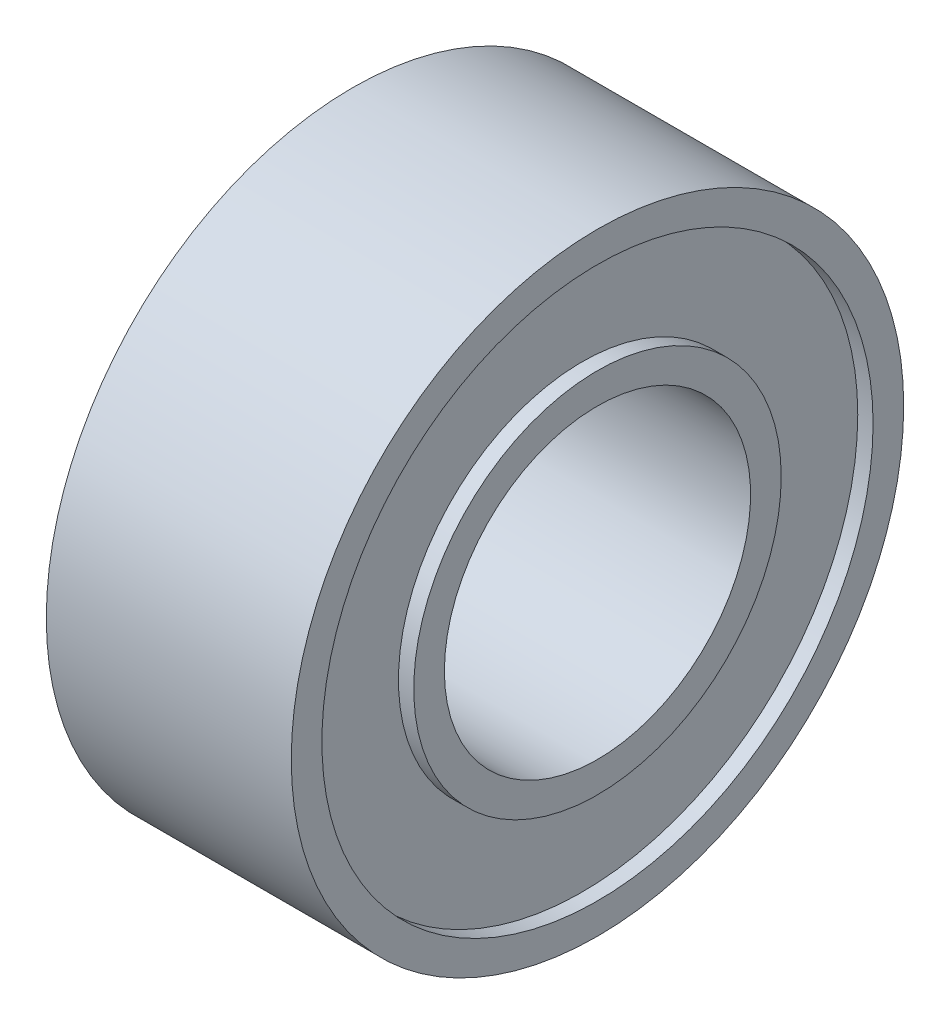
ISO-10303-21;
HEADER;
FILE_DESCRIPTION(('STEP AP214'),'2;1');
FILE_NAME('part.step','',(''),(''),'','','');
FILE_SCHEMA(('AUTOMOTIVE_DESIGN { 1 0 10303 214 1 1 1 1 }'));
ENDSEC;
DATA;
#1=APPLICATION_CONTEXT('core data for automotive mechanical design processes');
#2=APPLICATION_PROTOCOL_DEFINITION('international standard','automotive_design',2000,#1);
#3=PRODUCT_CONTEXT('',#1,'mechanical');
#4=PRODUCT('Part','Part','',(#3));
#5=PRODUCT_RELATED_PRODUCT_CATEGORY('part','',(#4));
#6=PRODUCT_DEFINITION_FORMATION('','',#4);
#7=PRODUCT_DEFINITION_CONTEXT('part definition',#1,'design');
#8=PRODUCT_DEFINITION('design','',#6,#7);
#9=PRODUCT_DEFINITION_SHAPE('','',#8);
#10=(LENGTH_UNIT() NAMED_UNIT(*) SI_UNIT(.MILLI.,.METRE.));
#11=(NAMED_UNIT(*) PLANE_ANGLE_UNIT() SI_UNIT($,.RADIAN.));
#12=(NAMED_UNIT(*) SI_UNIT($,.STERADIAN.) SOLID_ANGLE_UNIT());
#13=UNCERTAINTY_MEASURE_WITH_UNIT(LENGTH_MEASURE(1.E-05),#10,'distance_accuracy_value','');
#14=(GEOMETRIC_REPRESENTATION_CONTEXT(3) GLOBAL_UNCERTAINTY_ASSIGNED_CONTEXT((#13)) GLOBAL_UNIT_ASSIGNED_CONTEXT((#10,
#11,#12)) REPRESENTATION_CONTEXT('',''));
#15=CARTESIAN_POINT('',(0.,0.,0.));
#16=DIRECTION('',(0.,0.,1.));
#17=DIRECTION('',(1.,0.,0.));
#18=AXIS2_PLACEMENT_3D('',#15,#16,#17);
#19=CARTESIAN_POINT('',(211.7,534.,0.));
#20=DIRECTION('',(-1.,0.,0.));
#21=DIRECTION('',(0.,0.,1.));
#22=AXIS2_PLACEMENT_3D('',#19,#20,#21);
#23=PLANE('',#22);
#24=CARTESIAN_POINT('',(211.7,534.,0.));
#25=DIRECTION('',(-1.,0.,0.));
#26=DIRECTION('',(0.,0.,1.));
#27=AXIS2_PLACEMENT_3D('',#24,#25,#26);
#28=CIRCLE('',#27,2.50000000000003);
#29=CARTESIAN_POINT('',(211.7,534.,2.50000000000003));
#30=VERTEX_POINT('',#29);
#31=EDGE_CURVE('E43',#30,#30,#28,.T.);
#32=ORIENTED_EDGE('',*,*,#31,.T.);
#33=EDGE_LOOP('',(#32));
#34=FACE_BOUND('',#33,.T.);
#35=CARTESIAN_POINT('',(211.7,534.,0.));
#36=DIRECTION('',(1.,0.,0.));
#37=DIRECTION('',(0.,0.,-1.));
#38=AXIS2_PLACEMENT_3D('',#35,#36,#37);
#39=CIRCLE('',#38,3.);
#40=CARTESIAN_POINT('',(211.7,534.,-3.));
#41=VERTEX_POINT('',#40);
#42=EDGE_CURVE('E67',#41,#41,#39,.T.);
#43=ORIENTED_EDGE('',*,*,#42,.T.);
#44=EDGE_LOOP('',(#43));
#45=FACE_BOUND('',#44,.T.);
#46=ADVANCED_FACE('F30',(#34,#45),#23,.F.);
#47=CARTESIAN_POINT('',(207.7,534.,0.));
#48=DIRECTION('',(-1.,0.,0.));
#49=DIRECTION('',(0.,0.,1.));
#50=AXIS2_PLACEMENT_3D('',#47,#48,#49);
#51=PLANE('',#50);
#52=CARTESIAN_POINT('',(207.7,534.,0.));
#53=DIRECTION('',(-1.,0.,0.));
#54=DIRECTION('',(0.,0.,1.));
#55=AXIS2_PLACEMENT_3D('',#52,#53,#54);
#56=CIRCLE('',#55,2.50000000000003);
#57=CARTESIAN_POINT('',(207.7,534.,2.50000000000003));
#58=VERTEX_POINT('',#57);
#59=EDGE_CURVE('E41',#58,#58,#56,.T.);
#60=ORIENTED_EDGE('',*,*,#59,.F.);
#61=EDGE_LOOP('',(#60));
#62=FACE_BOUND('',#61,.T.);
#63=CARTESIAN_POINT('',(207.7,534.,0.));
#64=DIRECTION('',(-1.,0.,0.));
#65=DIRECTION('',(0.,0.,1.));
#66=AXIS2_PLACEMENT_3D('',#63,#64,#65);
#67=CIRCLE('',#66,3.);
#68=CARTESIAN_POINT('',(207.7,534.,3.));
#69=VERTEX_POINT('',#68);
#70=EDGE_CURVE('E55',#69,#69,#67,.T.);
#71=ORIENTED_EDGE('',*,*,#70,.T.);
#72=EDGE_LOOP('',(#71));
#73=FACE_BOUND('',#72,.T.);
#74=ADVANCED_FACE('F105',(#62,#73),#51,.T.);
#75=CARTESIAN_POINT('',(207.7,534.,0.));
#76=DIRECTION('',(-1.,0.,0.));
#77=DIRECTION('',(0.,0.,1.));
#78=AXIS2_PLACEMENT_3D('',#75,#76,#77);
#79=CIRCLE('',#78,4.5);
#80=CARTESIAN_POINT('',(207.7,534.,4.5));
#81=VERTEX_POINT('',#80);
#82=EDGE_CURVE('E49',#81,#81,#79,.T.);
#83=ORIENTED_EDGE('',*,*,#82,.F.);
#84=EDGE_LOOP('',(#83));
#85=FACE_BOUND('',#84,.T.);
#86=CARTESIAN_POINT('',(207.7,534.,0.));
#87=DIRECTION('',(-1.,0.,0.));
#88=DIRECTION('',(0.,0.,1.));
#89=AXIS2_PLACEMENT_3D('',#86,#87,#88);
#90=CIRCLE('',#89,5.);
#91=CARTESIAN_POINT('',(207.7,534.,5.));
#92=VERTEX_POINT('',#91);
#93=EDGE_CURVE('E10',#92,#92,#90,.T.);
#94=ORIENTED_EDGE('',*,*,#93,.T.);
#95=EDGE_LOOP('',(#94));
#96=FACE_BOUND('',#95,.T.);
#97=ADVANCED_FACE('F92',(#85,#96),#51,.T.);
#98=CARTESIAN_POINT('',(211.7,534.,0.));
#99=DIRECTION('',(1.,0.,0.));
#100=DIRECTION('',(0.,0.,-1.));
#101=AXIS2_PLACEMENT_3D('',#98,#99,#100);
#102=CIRCLE('',#101,4.50000000000001);
#103=CARTESIAN_POINT('',(211.7,534.,-4.50000000000001));
#104=VERTEX_POINT('',#103);
#105=EDGE_CURVE('E61',#104,#104,#102,.T.);
#106=ORIENTED_EDGE('',*,*,#105,.F.);
#107=EDGE_LOOP('',(#106));
#108=FACE_BOUND('',#107,.T.);
#109=CARTESIAN_POINT('',(211.7,534.,0.));
#110=DIRECTION('',(-1.,0.,0.));
#111=DIRECTION('',(0.,0.,1.));
#112=AXIS2_PLACEMENT_3D('',#109,#110,#111);
#113=CIRCLE('',#112,5.);
#114=CARTESIAN_POINT('',(211.7,534.,5.));
#115=VERTEX_POINT('',#114);
#116=EDGE_CURVE('E34',#115,#115,#113,.T.);
#117=ORIENTED_EDGE('',*,*,#116,.F.);
#118=EDGE_LOOP('',(#117));
#119=FACE_BOUND('',#118,.T.);
#120=ADVANCED_FACE('F89',(#108,#119),#23,.F.);
#121=CARTESIAN_POINT('',(207.7,534.,0.));
#122=DIRECTION('',(1.,0.,0.));
#123=DIRECTION('',(0.,0.,-1.));
#124=AXIS2_PLACEMENT_3D('',#121,#122,#123);
#125=CYLINDRICAL_SURFACE('',#124,5.);
#126=ORIENTED_EDGE('',*,*,#93,.F.);
#127=EDGE_LOOP('',(#126));
#128=FACE_BOUND('',#127,.T.);
#129=ORIENTED_EDGE('',*,*,#116,.T.);
#130=EDGE_LOOP('',(#129));
#131=FACE_BOUND('',#130,.T.);
#132=ADVANCED_FACE('F32',(#128,#131),#125,.T.);
#133=CARTESIAN_POINT('',(207.7,534.,0.));
#134=DIRECTION('',(1.,0.,0.));
#135=DIRECTION('',(0.,0.,-1.));
#136=AXIS2_PLACEMENT_3D('',#133,#134,#135);
#137=CYLINDRICAL_SURFACE('',#136,2.50000000000003);
#138=ORIENTED_EDGE('',*,*,#59,.T.);
#139=EDGE_LOOP('',(#138));
#140=FACE_BOUND('',#139,.T.);
#141=ORIENTED_EDGE('',*,*,#31,.F.);
#142=EDGE_LOOP('',(#141));
#143=FACE_BOUND('',#142,.T.);
#144=ADVANCED_FACE('F96',(#140,#143),#137,.F.);
#145=CARTESIAN_POINT('',(207.95,534.,0.));
#146=DIRECTION('',(-1.,0.,0.));
#147=DIRECTION('',(0.,0.,1.));
#148=AXIS2_PLACEMENT_3D('',#145,#146,#147);
#149=CYLINDRICAL_SURFACE('',#148,4.5);
#150=CARTESIAN_POINT('',(207.95,534.,0.));
#151=DIRECTION('',(-1.,0.,0.));
#152=DIRECTION('',(0.,0.,1.));
#153=AXIS2_PLACEMENT_3D('',#150,#151,#152);
#154=CIRCLE('',#153,4.5);
#155=CARTESIAN_POINT('',(207.95,534.,4.5));
#156=VERTEX_POINT('',#155);
#157=EDGE_CURVE('E46',#156,#156,#154,.T.);
#158=ORIENTED_EDGE('',*,*,#157,.F.);
#159=EDGE_LOOP('',(#158));
#160=FACE_BOUND('',#159,.T.);
#161=ORIENTED_EDGE('',*,*,#82,.T.);
#162=EDGE_LOOP('',(#161));
#163=FACE_BOUND('',#162,.T.);
#164=ADVANCED_FACE('F101',(#160,#163),#149,.F.);
#165=CARTESIAN_POINT('',(207.95,534.,0.));
#166=DIRECTION('',(-1.,0.,0.));
#167=DIRECTION('',(0.,0.,1.));
#168=AXIS2_PLACEMENT_3D('',#165,#166,#167);
#169=PLANE('',#168);
#170=CARTESIAN_POINT('',(207.95,534.,0.));
#171=DIRECTION('',(-1.,0.,0.));
#172=DIRECTION('',(0.,0.,1.));
#173=AXIS2_PLACEMENT_3D('',#170,#171,#172);
#174=CIRCLE('',#173,3.);
#175=CARTESIAN_POINT('',(207.95,534.,3.));
#176=VERTEX_POINT('',#175);
#177=EDGE_CURVE('E52',#176,#176,#174,.T.);
#178=ORIENTED_EDGE('',*,*,#177,.F.);
#179=EDGE_LOOP('',(#178));
#180=FACE_BOUND('',#179,.T.);
#181=ORIENTED_EDGE('',*,*,#157,.T.);
#182=EDGE_LOOP('',(#181));
#183=FACE_BOUND('',#182,.T.);
#184=ADVANCED_FACE('F118',(#180,#183),#169,.T.);
#185=CARTESIAN_POINT('',(207.95,534.,0.));
#186=DIRECTION('',(-1.,0.,0.));
#187=DIRECTION('',(0.,0.,1.));
#188=AXIS2_PLACEMENT_3D('',#185,#186,#187);
#189=CYLINDRICAL_SURFACE('',#188,3.);
#190=ORIENTED_EDGE('',*,*,#177,.T.);
#191=EDGE_LOOP('',(#190));
#192=FACE_BOUND('',#191,.T.);
#193=ORIENTED_EDGE('',*,*,#70,.F.);
#194=EDGE_LOOP('',(#193));
#195=FACE_BOUND('',#194,.T.);
#196=ADVANCED_FACE('F85',(#192,#195),#189,.T.);
#197=CARTESIAN_POINT('',(211.45,534.,0.));
#198=DIRECTION('',(1.,0.,0.));
#199=DIRECTION('',(0.,0.,-1.));
#200=AXIS2_PLACEMENT_3D('',#197,#198,#199);
#201=CYLINDRICAL_SURFACE('',#200,4.50000000000001);
#202=CARTESIAN_POINT('',(211.45,534.,0.));
#203=DIRECTION('',(1.,0.,0.));
#204=DIRECTION('',(0.,0.,-1.));
#205=AXIS2_PLACEMENT_3D('',#202,#203,#204);
#206=CIRCLE('',#205,4.50000000000001);
#207=CARTESIAN_POINT('',(211.45,534.,-4.50000000000001));
#208=VERTEX_POINT('',#207);
#209=EDGE_CURVE('E58',#208,#208,#206,.T.);
#210=ORIENTED_EDGE('',*,*,#209,.F.);
#211=EDGE_LOOP('',(#210));
#212=FACE_BOUND('',#211,.T.);
#213=ORIENTED_EDGE('',*,*,#105,.T.);
#214=EDGE_LOOP('',(#213));
#215=FACE_BOUND('',#214,.T.);
#216=ADVANCED_FACE('F79',(#212,#215),#201,.F.);
#217=CARTESIAN_POINT('',(211.45,534.,0.));
#218=DIRECTION('',(1.,0.,0.));
#219=DIRECTION('',(0.,0.,-1.));
#220=AXIS2_PLACEMENT_3D('',#217,#218,#219);
#221=PLANE('',#220);
#222=CARTESIAN_POINT('',(211.45,534.,0.));
#223=DIRECTION('',(1.,0.,0.));
#224=DIRECTION('',(0.,0.,-1.));
#225=AXIS2_PLACEMENT_3D('',#222,#223,#224);
#226=CIRCLE('',#225,3.);
#227=CARTESIAN_POINT('',(211.45,534.,-3.));
#228=VERTEX_POINT('',#227);
#229=EDGE_CURVE('E64',#228,#228,#226,.T.);
#230=ORIENTED_EDGE('',*,*,#229,.F.);
#231=EDGE_LOOP('',(#230));
#232=FACE_BOUND('',#231,.T.);
#233=ORIENTED_EDGE('',*,*,#209,.T.);
#234=EDGE_LOOP('',(#233));
#235=FACE_BOUND('',#234,.T.);
#236=ADVANCED_FACE('F76',(#232,#235),#221,.T.);
#237=CARTESIAN_POINT('',(211.45,534.,0.));
#238=DIRECTION('',(1.,0.,0.));
#239=DIRECTION('',(0.,0.,-1.));
#240=AXIS2_PLACEMENT_3D('',#237,#238,#239);
#241=CYLINDRICAL_SURFACE('',#240,3.);
#242=ORIENTED_EDGE('',*,*,#229,.T.);
#243=EDGE_LOOP('',(#242));
#244=FACE_BOUND('',#243,.T.);
#245=ORIENTED_EDGE('',*,*,#42,.F.);
#246=EDGE_LOOP('',(#245));
#247=FACE_BOUND('',#246,.T.);
#248=ADVANCED_FACE('F73',(#244,#247),#241,.T.);
#249=CLOSED_SHELL('',(#46,#74,#97,#120,#132,#144,#164,#184,#196,#216,#236,#248));
#250=MANIFOLD_SOLID_BREP('B2',#249);
#251=ADVANCED_BREP_SHAPE_REPRESENTATION('',(#18,#250),#14);
#252=SHAPE_DEFINITION_REPRESENTATION(#9,#251);
ENDSEC;
END-ISO-10303-21;
